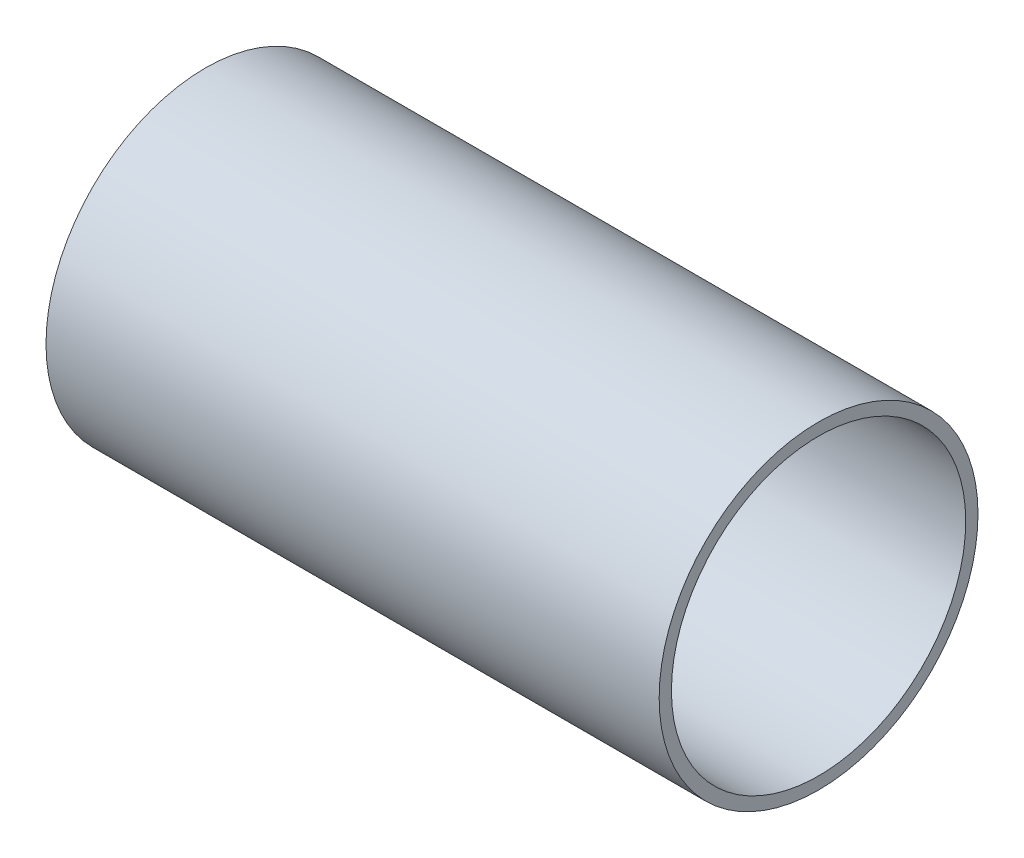
ISO-10303-21;
HEADER;
FILE_DESCRIPTION(('STEP AP214'),'2;1');
FILE_NAME('part.step','',(''),(''),'','','');
FILE_SCHEMA(('AUTOMOTIVE_DESIGN { 1 0 10303 214 1 1 1 1 }'));
ENDSEC;
DATA;
#1=APPLICATION_CONTEXT('core data for automotive mechanical design processes');
#2=APPLICATION_PROTOCOL_DEFINITION('international standard','automotive_design',2000,#1);
#3=PRODUCT_CONTEXT('',#1,'mechanical');
#4=PRODUCT('Part','Part','',(#3));
#5=PRODUCT_RELATED_PRODUCT_CATEGORY('part','',(#4));
#6=PRODUCT_DEFINITION_FORMATION('','',#4);
#7=PRODUCT_DEFINITION_CONTEXT('part definition',#1,'design');
#8=PRODUCT_DEFINITION('design','',#6,#7);
#9=PRODUCT_DEFINITION_SHAPE('','',#8);
#10=(LENGTH_UNIT() NAMED_UNIT(*) SI_UNIT(.MILLI.,.METRE.));
#11=(NAMED_UNIT(*) PLANE_ANGLE_UNIT() SI_UNIT($,.RADIAN.));
#12=(NAMED_UNIT(*) SI_UNIT($,.STERADIAN.) SOLID_ANGLE_UNIT());
#13=UNCERTAINTY_MEASURE_WITH_UNIT(LENGTH_MEASURE(1.E-05),#10,'distance_accuracy_value','');
#14=(GEOMETRIC_REPRESENTATION_CONTEXT(3) GLOBAL_UNCERTAINTY_ASSIGNED_CONTEXT((#13)) GLOBAL_UNIT_ASSIGNED_CONTEXT((#10,
#11,#12)) REPRESENTATION_CONTEXT('',''));
#15=CARTESIAN_POINT('',(0.,0.,0.));
#16=DIRECTION('',(0.,0.,1.));
#17=DIRECTION('',(1.,0.,0.));
#18=AXIS2_PLACEMENT_3D('',#15,#16,#17);
#19=CARTESIAN_POINT('',(558.800000053401,0.,-1.2699999732944));
#20=DIRECTION('',(-1.,0.,0.));
#21=DIRECTION('',(0.,0.,1.));
#22=AXIS2_PLACEMENT_3D('',#19,#20,#21);
#23=CYLINDRICAL_SURFACE('',#22,49.53);
#24=CARTESIAN_POINT('',(368.300000053401,0.,-1.26999997329437));
#25=DIRECTION('',(1.,0.,0.));
#26=DIRECTION('',(0.,0.,-1.));
#27=AXIS2_PLACEMENT_3D('',#24,#25,#26);
#28=CIRCLE('',#27,49.53);
#29=CARTESIAN_POINT('',(368.300000053401,0.,-50.7999999732944));
#30=VERTEX_POINT('',#29);
#31=EDGE_CURVE('E48',#30,#30,#28,.T.);
#32=ORIENTED_EDGE('',*,*,#31,.T.);
#33=EDGE_LOOP('',(#32));
#34=FACE_BOUND('',#33,.T.);
#35=CARTESIAN_POINT('',(558.800000053401,0.,-1.2699999732944));
#36=DIRECTION('',(1.,0.,0.));
#37=DIRECTION('',(0.,0.,-1.));
#38=AXIS2_PLACEMENT_3D('',#35,#36,#37);
#39=CIRCLE('',#38,49.53);
#40=CARTESIAN_POINT('',(558.800000053401,0.,-50.7999999732944));
#41=VERTEX_POINT('',#40);
#42=EDGE_CURVE('E10',#41,#41,#39,.T.);
#43=ORIENTED_EDGE('',*,*,#42,.F.);
#44=EDGE_LOOP('',(#43));
#45=FACE_BOUND('',#44,.T.);
#46=ADVANCED_FACE('F41',(#34,#45),#23,.T.);
#47=CARTESIAN_POINT('',(558.800000053401,0.,-1.2699999732944));
#48=DIRECTION('',(1.,0.,0.));
#49=DIRECTION('',(0.,0.,-1.));
#50=AXIS2_PLACEMENT_3D('',#47,#48,#49);
#51=PLANE('',#50);
#52=CARTESIAN_POINT('',(558.800000053401,0.,-1.2699999732944));
#53=DIRECTION('',(1.,0.,0.));
#54=DIRECTION('',(0.,0.,-1.));
#55=AXIS2_PLACEMENT_3D('',#52,#53,#54);
#56=CIRCLE('',#55,45.72);
#57=CARTESIAN_POINT('',(558.800000053401,0.,-46.9899999732944));
#58=VERTEX_POINT('',#57);
#59=EDGE_CURVE('E53',#58,#58,#56,.T.);
#60=ORIENTED_EDGE('',*,*,#59,.F.);
#61=EDGE_LOOP('',(#60));
#62=FACE_BOUND('',#61,.T.);
#63=ORIENTED_EDGE('',*,*,#42,.T.);
#64=EDGE_LOOP('',(#63));
#65=FACE_BOUND('',#64,.T.);
#66=ADVANCED_FACE('F74',(#62,#65),#51,.T.);
#67=CARTESIAN_POINT('',(368.300000053401,0.,-1.26999997329437));
#68=DIRECTION('',(1.,0.,0.));
#69=DIRECTION('',(0.,0.,-1.));
#70=AXIS2_PLACEMENT_3D('',#67,#68,#69);
#71=PLANE('',#70);
#72=CARTESIAN_POINT('',(368.300000053401,0.,-1.26999997329437));
#73=DIRECTION('',(1.,0.,0.));
#74=DIRECTION('',(0.,0.,-1.));
#75=AXIS2_PLACEMENT_3D('',#72,#73,#74);
#76=CIRCLE('',#75,45.72);
#77=CARTESIAN_POINT('',(368.300000053401,0.,-46.9899999732944));
#78=VERTEX_POINT('',#77);
#79=EDGE_CURVE('E58',#78,#78,#76,.T.);
#80=ORIENTED_EDGE('',*,*,#79,.T.);
#81=EDGE_LOOP('',(#80));
#82=FACE_BOUND('',#81,.T.);
#83=ORIENTED_EDGE('',*,*,#31,.F.);
#84=EDGE_LOOP('',(#83));
#85=FACE_BOUND('',#84,.T.);
#86=ADVANCED_FACE('F65',(#82,#85),#71,.F.);
#87=CARTESIAN_POINT('',(558.800000053401,0.,-1.2699999732944));
#88=DIRECTION('',(-1.,0.,0.));
#89=DIRECTION('',(0.,0.,1.));
#90=AXIS2_PLACEMENT_3D('',#87,#88,#89);
#91=CYLINDRICAL_SURFACE('',#90,45.72);
#92=ORIENTED_EDGE('',*,*,#79,.F.);
#93=EDGE_LOOP('',(#92));
#94=FACE_BOUND('',#93,.T.);
#95=ORIENTED_EDGE('',*,*,#59,.T.);
#96=EDGE_LOOP('',(#95));
#97=FACE_BOUND('',#96,.T.);
#98=ADVANCED_FACE('F68',(#94,#97),#91,.F.);
#99=CLOSED_SHELL('',(#46,#66,#86,#98));
#100=MANIFOLD_SOLID_BREP('B2',#99);
#101=ADVANCED_BREP_SHAPE_REPRESENTATION('',(#18,#100),#14);
#102=SHAPE_DEFINITION_REPRESENTATION(#9,#101);
ENDSEC;
END-ISO-10303-21;
